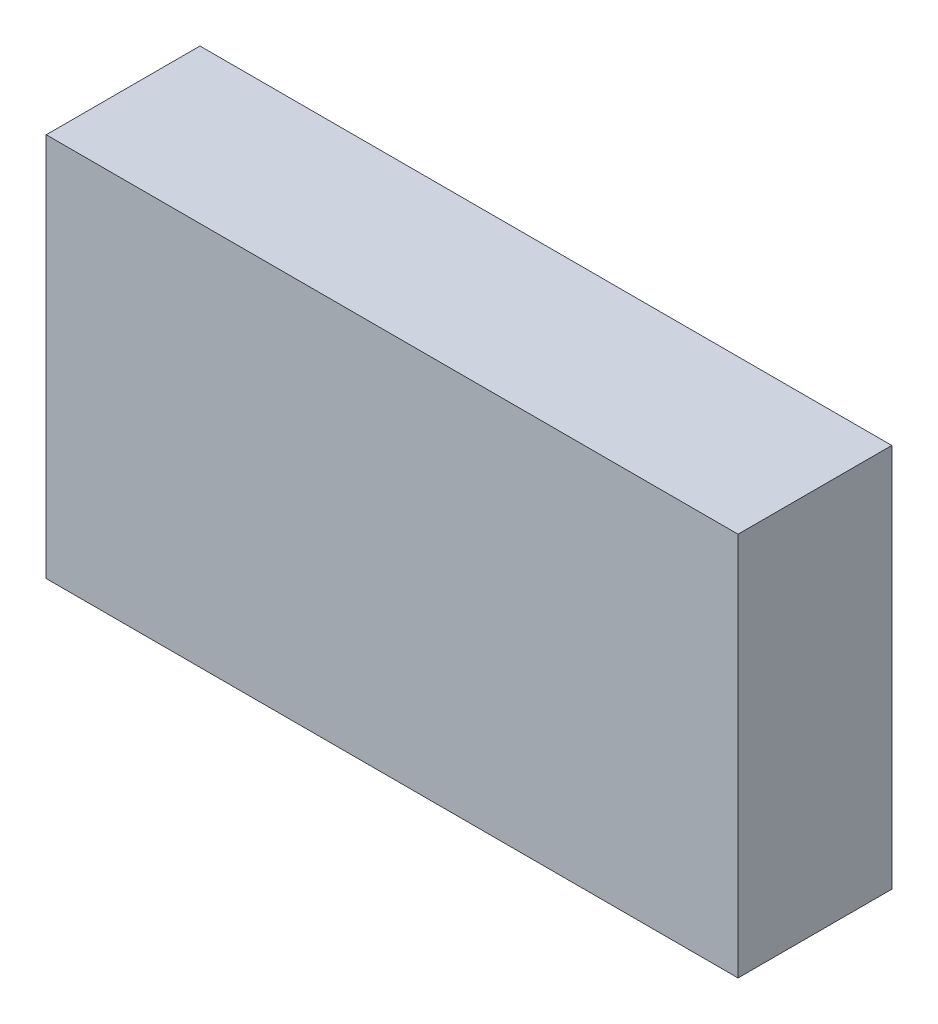
ISO-10303-21;
HEADER;
FILE_DESCRIPTION(('STEP AP214'),'2;1');
FILE_NAME('part.step','',(''),(''),'','','');
FILE_SCHEMA(('AUTOMOTIVE_DESIGN { 1 0 10303 214 1 1 1 1 }'));
ENDSEC;
DATA;
#1=APPLICATION_CONTEXT('core data for automotive mechanical design processes');
#2=APPLICATION_PROTOCOL_DEFINITION('international standard','automotive_design',2000,#1);
#3=PRODUCT_CONTEXT('',#1,'mechanical');
#4=PRODUCT('Part','Part','',(#3));
#5=PRODUCT_RELATED_PRODUCT_CATEGORY('part','',(#4));
#6=PRODUCT_DEFINITION_FORMATION('','',#4);
#7=PRODUCT_DEFINITION_CONTEXT('part definition',#1,'design');
#8=PRODUCT_DEFINITION('design','',#6,#7);
#9=PRODUCT_DEFINITION_SHAPE('','',#8);
#10=(LENGTH_UNIT() NAMED_UNIT(*) SI_UNIT(.MILLI.,.METRE.));
#11=(NAMED_UNIT(*) PLANE_ANGLE_UNIT() SI_UNIT($,.RADIAN.));
#12=(NAMED_UNIT(*) SI_UNIT($,.STERADIAN.) SOLID_ANGLE_UNIT());
#13=UNCERTAINTY_MEASURE_WITH_UNIT(LENGTH_MEASURE(1.E-05),#10,'distance_accuracy_value','');
#14=(GEOMETRIC_REPRESENTATION_CONTEXT(3) GLOBAL_UNCERTAINTY_ASSIGNED_CONTEXT((#13)) GLOBAL_UNIT_ASSIGNED_CONTEXT((#10,
#11,#12)) REPRESENTATION_CONTEXT('',''));
#15=CARTESIAN_POINT('',(0.,0.,0.));
#16=DIRECTION('',(0.,0.,1.));
#17=DIRECTION('',(1.,0.,0.));
#18=AXIS2_PLACEMENT_3D('',#15,#16,#17);
#19=CARTESIAN_POINT('',(-2.05,0.375,0.));
#20=DIRECTION('',(1.,0.,0.));
#21=DIRECTION('',(0.,0.,1.));
#22=AXIS2_PLACEMENT_3D('',#19,#20,#21);
#23=PLANE('',#22);
#24=DIRECTION('',(0.,1.,0.));
#25=VECTOR('',#24,1.);
#26=CARTESIAN_POINT('',(-2.05,0.375,0.1));
#27=LINE('',#26,#25);
#28=CARTESIAN_POINT('',(-2.05,0.375,0.1));
#29=VERTEX_POINT('',#28);
#30=CARTESIAN_POINT('',(-2.05,0.625,0.1));
#31=VERTEX_POINT('',#30);
#32=EDGE_CURVE('E11',#29,#31,#27,.T.);
#33=ORIENTED_EDGE('',*,*,#32,.T.);
#34=DIRECTION('',(0.,0.,1.));
#35=VECTOR('',#34,1.);
#36=CARTESIAN_POINT('',(-2.05,0.625,0.));
#37=LINE('',#36,#35);
#38=CARTESIAN_POINT('',(-2.05,0.625,0.));
#39=VERTEX_POINT('',#38);
#40=EDGE_CURVE('E24',#39,#31,#37,.T.);
#41=ORIENTED_EDGE('',*,*,#40,.F.);
#42=DIRECTION('',(0.,1.,0.));
#43=VECTOR('',#42,1.);
#44=CARTESIAN_POINT('',(-2.05,0.375,0.));
#45=LINE('',#44,#43);
#46=CARTESIAN_POINT('',(-2.05,0.375,0.));
#47=VERTEX_POINT('',#46);
#48=EDGE_CURVE('E86',#47,#39,#45,.T.);
#49=ORIENTED_EDGE('',*,*,#48,.F.);
#50=DIRECTION('',(0.,0.,1.));
#51=VECTOR('',#50,1.);
#52=CARTESIAN_POINT('',(-2.05,0.375,0.));
#53=LINE('',#52,#51);
#54=EDGE_CURVE('E36',#47,#29,#53,.T.);
#55=ORIENTED_EDGE('',*,*,#54,.T.);
#56=EDGE_LOOP('',(#33,#41,#49,#55));
#57=FACE_BOUND('',#56,.T.);
#58=ADVANCED_FACE('F17',(#57),#23,.F.);
#59=CARTESIAN_POINT('',(-1.6,0.375,0.));
#60=DIRECTION('',(1.,0.,0.));
#61=DIRECTION('',(0.,0.,1.));
#62=AXIS2_PLACEMENT_3D('',#59,#60,#61);
#63=PLANE('',#62);
#64=DIRECTION('',(0.,0.,1.));
#65=VECTOR('',#64,1.);
#66=CARTESIAN_POINT('',(-1.6,0.375,0.));
#67=LINE('',#66,#65);
#68=CARTESIAN_POINT('',(-1.6,0.375,0.));
#69=VERTEX_POINT('',#68);
#70=CARTESIAN_POINT('',(-1.6,0.375,0.1));
#71=VERTEX_POINT('',#70);
#72=EDGE_CURVE('E83',#69,#71,#67,.T.);
#73=ORIENTED_EDGE('',*,*,#72,.F.);
#74=DIRECTION('',(0.,1.,0.));
#75=VECTOR('',#74,1.);
#76=CARTESIAN_POINT('',(-1.6,0.375,0.));
#77=LINE('',#76,#75);
#78=CARTESIAN_POINT('',(-1.6,0.625,0.));
#79=VERTEX_POINT('',#78);
#80=EDGE_CURVE('E63',#69,#79,#77,.T.);
#81=ORIENTED_EDGE('',*,*,#80,.T.);
#82=DIRECTION('',(0.,0.,1.));
#83=VECTOR('',#82,1.);
#84=CARTESIAN_POINT('',(-1.6,0.625,0.));
#85=LINE('',#84,#83);
#86=CARTESIAN_POINT('',(-1.6,0.625,0.1));
#87=VERTEX_POINT('',#86);
#88=EDGE_CURVE('E57',#79,#87,#85,.T.);
#89=ORIENTED_EDGE('',*,*,#88,.T.);
#90=DIRECTION('',(0.,1.,0.));
#91=VECTOR('',#90,1.);
#92=CARTESIAN_POINT('',(-1.6,0.375,0.1));
#93=LINE('',#92,#91);
#94=EDGE_CURVE('E60',#71,#87,#93,.T.);
#95=ORIENTED_EDGE('',*,*,#94,.F.);
#96=EDGE_LOOP('',(#73,#81,#89,#95));
#97=FACE_BOUND('',#96,.T.);
#98=ADVANCED_FACE('F59',(#97),#63,.T.);
#99=CARTESIAN_POINT('',(-2.05,0.375,0.));
#100=DIRECTION('',(0.,1.,0.));
#101=DIRECTION('',(0.,0.,1.));
#102=AXIS2_PLACEMENT_3D('',#99,#100,#101);
#103=PLANE('',#102);
#104=ORIENTED_EDGE('',*,*,#72,.T.);
#105=DIRECTION('',(1.,0.,0.));
#106=VECTOR('',#105,1.);
#107=CARTESIAN_POINT('',(-2.05,0.375,0.1));
#108=LINE('',#107,#106);
#109=EDGE_CURVE('E71',#29,#71,#108,.T.);
#110=ORIENTED_EDGE('',*,*,#109,.F.);
#111=ORIENTED_EDGE('',*,*,#54,.F.);
#112=DIRECTION('',(1.,0.,0.));
#113=VECTOR('',#112,1.);
#114=CARTESIAN_POINT('',(-2.05,0.375,0.));
#115=LINE('',#114,#113);
#116=EDGE_CURVE('E76',#47,#69,#115,.T.);
#117=ORIENTED_EDGE('',*,*,#116,.T.);
#118=EDGE_LOOP('',(#104,#110,#111,#117));
#119=FACE_BOUND('',#118,.T.);
#120=ADVANCED_FACE('F91',(#119),#103,.F.);
#121=CARTESIAN_POINT('',(-2.05,0.625,0.));
#122=DIRECTION('',(0.,1.,0.));
#123=DIRECTION('',(0.,0.,1.));
#124=AXIS2_PLACEMENT_3D('',#121,#122,#123);
#125=PLANE('',#124);
#126=DIRECTION('',(1.,0.,0.));
#127=VECTOR('',#126,1.);
#128=CARTESIAN_POINT('',(-2.05,0.625,0.));
#129=LINE('',#128,#127);
#130=EDGE_CURVE('E74',#39,#79,#129,.T.);
#131=ORIENTED_EDGE('',*,*,#130,.F.);
#132=ORIENTED_EDGE('',*,*,#40,.T.);
#133=DIRECTION('',(1.,0.,0.));
#134=VECTOR('',#133,1.);
#135=CARTESIAN_POINT('',(-2.05,0.625,0.1));
#136=LINE('',#135,#134);
#137=EDGE_CURVE('E69',#31,#87,#136,.T.);
#138=ORIENTED_EDGE('',*,*,#137,.T.);
#139=ORIENTED_EDGE('',*,*,#88,.F.);
#140=EDGE_LOOP('',(#131,#132,#138,#139));
#141=FACE_BOUND('',#140,.T.);
#142=ADVANCED_FACE('F73',(#141),#125,.T.);
#143=CARTESIAN_POINT('',(-2.05,0.375,0.));
#144=DIRECTION('',(0.,0.,1.));
#145=DIRECTION('',(1.,0.,0.));
#146=AXIS2_PLACEMENT_3D('',#143,#144,#145);
#147=PLANE('',#146);
#148=ORIENTED_EDGE('',*,*,#130,.T.);
#149=ORIENTED_EDGE('',*,*,#80,.F.);
#150=ORIENTED_EDGE('',*,*,#116,.F.);
#151=ORIENTED_EDGE('',*,*,#48,.T.);
#152=EDGE_LOOP('',(#148,#149,#150,#151));
#153=FACE_BOUND('',#152,.T.);
#154=ADVANCED_FACE('F89',(#153),#147,.F.);
#155=CARTESIAN_POINT('',(-2.05,0.375,0.1));
#156=DIRECTION('',(0.,0.,1.));
#157=DIRECTION('',(1.,0.,0.));
#158=AXIS2_PLACEMENT_3D('',#155,#156,#157);
#159=PLANE('',#158);
#160=ORIENTED_EDGE('',*,*,#32,.F.);
#161=ORIENTED_EDGE('',*,*,#109,.T.);
#162=ORIENTED_EDGE('',*,*,#94,.T.);
#163=ORIENTED_EDGE('',*,*,#137,.F.);
#164=EDGE_LOOP('',(#160,#161,#162,#163));
#165=FACE_BOUND('',#164,.T.);
#166=ADVANCED_FACE('F68',(#165),#159,.T.);
#167=CLOSED_SHELL('',(#58,#98,#120,#142,#154,#166));
#168=MANIFOLD_SOLID_BREP('B1',#167);
#169=ADVANCED_BREP_SHAPE_REPRESENTATION('',(#18,#168),#14);
#170=SHAPE_DEFINITION_REPRESENTATION(#9,#169);
ENDSEC;
END-ISO-10303-21;
